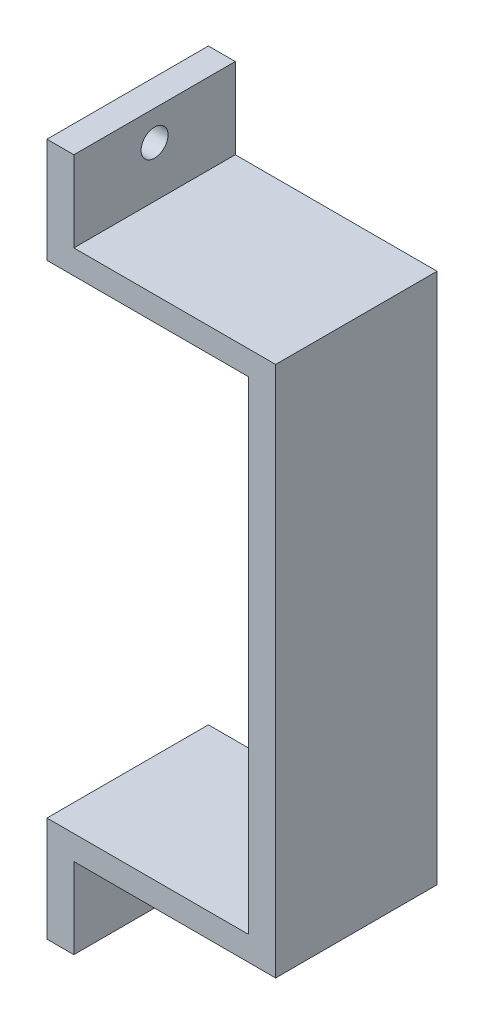
ISO-10303-21;
HEADER;
FILE_DESCRIPTION(('STEP AP214'),'2;1');
FILE_NAME('part.step','',(''),(''),'','','');
FILE_SCHEMA(('AUTOMOTIVE_DESIGN { 1 0 10303 214 1 1 1 1 }'));
ENDSEC;
DATA;
#1=APPLICATION_CONTEXT('core data for automotive mechanical design processes');
#2=APPLICATION_PROTOCOL_DEFINITION('international standard','automotive_design',2000,#1);
#3=PRODUCT_CONTEXT('',#1,'mechanical');
#4=PRODUCT('Part','Part','',(#3));
#5=PRODUCT_RELATED_PRODUCT_CATEGORY('part','',(#4));
#6=PRODUCT_DEFINITION_FORMATION('','',#4);
#7=PRODUCT_DEFINITION_CONTEXT('part definition',#1,'design');
#8=PRODUCT_DEFINITION('design','',#6,#7);
#9=PRODUCT_DEFINITION_SHAPE('','',#8);
#10=(LENGTH_UNIT() NAMED_UNIT(*) SI_UNIT(.MILLI.,.METRE.));
#11=(NAMED_UNIT(*) PLANE_ANGLE_UNIT() SI_UNIT($,.RADIAN.));
#12=(NAMED_UNIT(*) SI_UNIT($,.STERADIAN.) SOLID_ANGLE_UNIT());
#13=UNCERTAINTY_MEASURE_WITH_UNIT(LENGTH_MEASURE(1.E-05),#10,'distance_accuracy_value','');
#14=(GEOMETRIC_REPRESENTATION_CONTEXT(3) GLOBAL_UNCERTAINTY_ASSIGNED_CONTEXT((#13)) GLOBAL_UNIT_ASSIGNED_CONTEXT((#10,
#11,#12)) REPRESENTATION_CONTEXT('',''));
#15=CARTESIAN_POINT('',(0.,0.,0.));
#16=DIRECTION('',(0.,0.,1.));
#17=DIRECTION('',(1.,0.,0.));
#18=AXIS2_PLACEMENT_3D('',#15,#16,#17);
#19=CARTESIAN_POINT('',(0.,25.75,12.));
#20=DIRECTION('',(0.,-1.,0.));
#21=DIRECTION('',(0.,0.,-1.));
#22=AXIS2_PLACEMENT_3D('',#19,#20,#21);
#23=PLANE('',#22);
#24=DIRECTION('',(-1.,0.,0.));
#25=VECTOR('',#24,1.);
#26=CARTESIAN_POINT('',(0.,25.75,0.));
#27=LINE('',#26,#25);
#28=CARTESIAN_POINT('',(2.,25.75,0.));
#29=VERTEX_POINT('',#28);
#30=CARTESIAN_POINT('',(0.,25.75,0.));
#31=VERTEX_POINT('',#30);
#32=EDGE_CURVE('E155',#29,#31,#27,.T.);
#33=ORIENTED_EDGE('',*,*,#32,.T.);
#34=DIRECTION('',(0.,0.,-1.));
#35=VECTOR('',#34,1.);
#36=CARTESIAN_POINT('',(0.,25.75,12.));
#37=LINE('',#36,#35);
#38=CARTESIAN_POINT('',(0.,25.75,12.));
#39=VERTEX_POINT('',#38);
#40=EDGE_CURVE('E11',#39,#31,#37,.T.);
#41=ORIENTED_EDGE('',*,*,#40,.F.);
#42=DIRECTION('',(-1.,0.,0.));
#43=VECTOR('',#42,1.);
#44=CARTESIAN_POINT('',(0.,25.75,12.));
#45=LINE('',#44,#43);
#46=CARTESIAN_POINT('',(2.,25.75,12.));
#47=VERTEX_POINT('',#46);
#48=EDGE_CURVE('E178',#47,#39,#45,.T.);
#49=ORIENTED_EDGE('',*,*,#48,.F.);
#50=DIRECTION('',(0.,0.,-1.));
#51=VECTOR('',#50,1.);
#52=CARTESIAN_POINT('',(2.,25.75,12.));
#53=LINE('',#52,#51);
#54=EDGE_CURVE('E151',#47,#29,#53,.T.);
#55=ORIENTED_EDGE('',*,*,#54,.T.);
#56=EDGE_LOOP('',(#33,#41,#49,#55));
#57=FACE_BOUND('',#56,.T.);
#58=ADVANCED_FACE('F33',(#57),#23,.F.);
#59=CARTESIAN_POINT('',(0.,25.75,12.));
#60=DIRECTION('',(1.,0.,0.));
#61=DIRECTION('',(0.,1.,0.));
#62=AXIS2_PLACEMENT_3D('',#59,#60,#61);
#63=PLANE('',#62);
#64=CARTESIAN_POINT('',(0.,23.5311167080973,6.));
#65=DIRECTION('',(-1.,0.,0.));
#66=DIRECTION('',(0.,-1.,0.));
#67=AXIS2_PLACEMENT_3D('',#64,#65,#66);
#68=CIRCLE('',#67,1.);
#69=CARTESIAN_POINT('',(0.,22.5311167080973,6.));
#70=VERTEX_POINT('',#69);
#71=EDGE_CURVE('E202',#70,#70,#68,.T.);
#72=ORIENTED_EDGE('',*,*,#71,.F.);
#73=EDGE_LOOP('',(#72));
#74=FACE_BOUND('',#73,.T.);
#75=DIRECTION('',(0.,-1.,0.));
#76=VECTOR('',#75,1.);
#77=CARTESIAN_POINT('',(0.,25.75,0.));
#78=LINE('',#77,#76);
#79=CARTESIAN_POINT('',(0.,17.95,0.));
#80=VERTEX_POINT('',#79);
#81=EDGE_CURVE('E158',#31,#80,#78,.T.);
#82=ORIENTED_EDGE('',*,*,#81,.T.);
#83=DIRECTION('',(0.,0.,-1.));
#84=VECTOR('',#83,1.);
#85=CARTESIAN_POINT('',(0.,17.95,12.));
#86=LINE('',#85,#84);
#87=CARTESIAN_POINT('',(0.,17.95,12.));
#88=VERTEX_POINT('',#87);
#89=EDGE_CURVE('E42',#88,#80,#86,.T.);
#90=ORIENTED_EDGE('',*,*,#89,.F.);
#91=DIRECTION('',(0.,-1.,0.));
#92=VECTOR('',#91,1.);
#93=CARTESIAN_POINT('',(0.,25.75,12.));
#94=LINE('',#93,#92);
#95=EDGE_CURVE('E106',#39,#88,#94,.T.);
#96=ORIENTED_EDGE('',*,*,#95,.F.);
#97=ORIENTED_EDGE('',*,*,#40,.T.);
#98=EDGE_LOOP('',(#82,#90,#96,#97));
#99=FACE_BOUND('',#98,.T.);
#100=ADVANCED_FACE('F254',(#74,#99),#63,.F.);
#101=CARTESIAN_POINT('',(0.,17.95,12.));
#102=DIRECTION('',(0.,1.,0.));
#103=DIRECTION('',(0.,0.,1.));
#104=AXIS2_PLACEMENT_3D('',#101,#102,#103);
#105=PLANE('',#104);
#106=DIRECTION('',(1.,0.,0.));
#107=VECTOR('',#106,1.);
#108=CARTESIAN_POINT('',(0.,17.95,0.));
#109=LINE('',#108,#107);
#110=CARTESIAN_POINT('',(15.,17.95,0.));
#111=VERTEX_POINT('',#110);
#112=EDGE_CURVE('E161',#80,#111,#109,.T.);
#113=ORIENTED_EDGE('',*,*,#112,.T.);
#114=DIRECTION('',(0.,0.,-1.));
#115=VECTOR('',#114,1.);
#116=CARTESIAN_POINT('',(15.,17.95,12.));
#117=LINE('',#116,#115);
#118=CARTESIAN_POINT('',(15.,17.95,12.));
#119=VERTEX_POINT('',#118);
#120=EDGE_CURVE('E197',#119,#111,#117,.T.);
#121=ORIENTED_EDGE('',*,*,#120,.F.);
#122=DIRECTION('',(1.,0.,0.));
#123=VECTOR('',#122,1.);
#124=CARTESIAN_POINT('',(0.,17.95,12.));
#125=LINE('',#124,#123);
#126=EDGE_CURVE('E215',#88,#119,#125,.T.);
#127=ORIENTED_EDGE('',*,*,#126,.F.);
#128=ORIENTED_EDGE('',*,*,#89,.T.);
#129=EDGE_LOOP('',(#113,#121,#127,#128));
#130=FACE_BOUND('',#129,.T.);
#131=ADVANCED_FACE('F258',(#130),#105,.F.);
#132=CARTESIAN_POINT('',(15.,17.95,12.));
#133=DIRECTION('',(1.,0.,0.));
#134=DIRECTION('',(0.,1.,0.));
#135=AXIS2_PLACEMENT_3D('',#132,#133,#134);
#136=PLANE('',#135);
#137=DIRECTION('',(0.,-1.,0.));
#138=VECTOR('',#137,1.);
#139=CARTESIAN_POINT('',(15.,17.95,0.));
#140=LINE('',#139,#138);
#141=CARTESIAN_POINT('',(15.,-17.95,0.));
#142=VERTEX_POINT('',#141);
#143=EDGE_CURVE('E163',#111,#142,#140,.T.);
#144=ORIENTED_EDGE('',*,*,#143,.T.);
#145=DIRECTION('',(0.,0.,-1.));
#146=VECTOR('',#145,1.);
#147=CARTESIAN_POINT('',(15.,-17.95,12.));
#148=LINE('',#147,#146);
#149=CARTESIAN_POINT('',(15.,-17.95,12.));
#150=VERTEX_POINT('',#149);
#151=EDGE_CURVE('E194',#150,#142,#148,.T.);
#152=ORIENTED_EDGE('',*,*,#151,.F.);
#153=DIRECTION('',(0.,-1.,0.));
#154=VECTOR('',#153,1.);
#155=CARTESIAN_POINT('',(15.,17.95,12.));
#156=LINE('',#155,#154);
#157=EDGE_CURVE('E217',#119,#150,#156,.T.);
#158=ORIENTED_EDGE('',*,*,#157,.F.);
#159=ORIENTED_EDGE('',*,*,#120,.T.);
#160=EDGE_LOOP('',(#144,#152,#158,#159));
#161=FACE_BOUND('',#160,.T.);
#162=ADVANCED_FACE('F263',(#161),#136,.F.);
#163=CARTESIAN_POINT('',(15.,-17.95,12.));
#164=DIRECTION('',(0.,-1.,0.));
#165=DIRECTION('',(1.,0.,0.));
#166=AXIS2_PLACEMENT_3D('',#163,#164,#165);
#167=PLANE('',#166);
#168=DIRECTION('',(-1.,0.,0.));
#169=VECTOR('',#168,1.);
#170=CARTESIAN_POINT('',(15.,-17.95,0.));
#171=LINE('',#170,#169);
#172=CARTESIAN_POINT('',(0.,-17.95,0.));
#173=VERTEX_POINT('',#172);
#174=EDGE_CURVE('E165',#142,#173,#171,.T.);
#175=ORIENTED_EDGE('',*,*,#174,.T.);
#176=DIRECTION('',(0.,0.,-1.));
#177=VECTOR('',#176,1.);
#178=CARTESIAN_POINT('',(0.,-17.95,12.));
#179=LINE('',#178,#177);
#180=CARTESIAN_POINT('',(0.,-17.95,12.));
#181=VERTEX_POINT('',#180);
#182=EDGE_CURVE('E191',#181,#173,#179,.T.);
#183=ORIENTED_EDGE('',*,*,#182,.F.);
#184=DIRECTION('',(-1.,0.,0.));
#185=VECTOR('',#184,1.);
#186=CARTESIAN_POINT('',(15.,-17.95,12.));
#187=LINE('',#186,#185);
#188=EDGE_CURVE('E219',#150,#181,#187,.T.);
#189=ORIENTED_EDGE('',*,*,#188,.F.);
#190=ORIENTED_EDGE('',*,*,#151,.T.);
#191=EDGE_LOOP('',(#175,#183,#189,#190));
#192=FACE_BOUND('',#191,.T.);
#193=ADVANCED_FACE('F269',(#192),#167,.F.);
#194=CARTESIAN_POINT('',(0.,-17.95,12.));
#195=DIRECTION('',(1.,0.,0.));
#196=DIRECTION('',(0.,1.,0.));
#197=AXIS2_PLACEMENT_3D('',#194,#195,#196);
#198=PLANE('',#197);
#199=CARTESIAN_POINT('',(0.,-22.75,6.));
#200=DIRECTION('',(-1.,0.,0.));
#201=DIRECTION('',(0.,-1.,0.));
#202=AXIS2_PLACEMENT_3D('',#199,#200,#201);
#203=CIRCLE('',#202,1.);
#204=CARTESIAN_POINT('',(0.,-23.75,6.));
#205=VERTEX_POINT('',#204);
#206=EDGE_CURVE('E210',#205,#205,#203,.T.);
#207=ORIENTED_EDGE('',*,*,#206,.F.);
#208=EDGE_LOOP('',(#207));
#209=FACE_BOUND('',#208,.T.);
#210=DIRECTION('',(0.,-1.,0.));
#211=VECTOR('',#210,1.);
#212=CARTESIAN_POINT('',(0.,-17.95,0.));
#213=LINE('',#212,#211);
#214=CARTESIAN_POINT('',(0.,-25.75,0.));
#215=VERTEX_POINT('',#214);
#216=EDGE_CURVE('E167',#173,#215,#213,.T.);
#217=ORIENTED_EDGE('',*,*,#216,.T.);
#218=DIRECTION('',(0.,0.,-1.));
#219=VECTOR('',#218,1.);
#220=CARTESIAN_POINT('',(0.,-25.75,12.));
#221=LINE('',#220,#219);
#222=CARTESIAN_POINT('',(0.,-25.75,12.));
#223=VERTEX_POINT('',#222);
#224=EDGE_CURVE('E188',#223,#215,#221,.T.);
#225=ORIENTED_EDGE('',*,*,#224,.F.);
#226=DIRECTION('',(0.,-1.,0.));
#227=VECTOR('',#226,1.);
#228=CARTESIAN_POINT('',(0.,-17.95,12.));
#229=LINE('',#228,#227);
#230=EDGE_CURVE('E221',#181,#223,#229,.T.);
#231=ORIENTED_EDGE('',*,*,#230,.F.);
#232=ORIENTED_EDGE('',*,*,#182,.T.);
#233=EDGE_LOOP('',(#217,#225,#231,#232));
#234=FACE_BOUND('',#233,.T.);
#235=ADVANCED_FACE('F273',(#209,#234),#198,.F.);
#236=CARTESIAN_POINT('',(2.00000000000001,-25.75,12.));
#237=DIRECTION('',(0.,1.,0.));
#238=DIRECTION('',(0.,0.,1.));
#239=AXIS2_PLACEMENT_3D('',#236,#237,#238);
#240=PLANE('',#239);
#241=DIRECTION('',(1.,0.,0.));
#242=VECTOR('',#241,1.);
#243=CARTESIAN_POINT('',(2.00000000000001,-25.75,0.));
#244=LINE('',#243,#242);
#245=CARTESIAN_POINT('',(2.00000000000001,-25.75,0.));
#246=VERTEX_POINT('',#245);
#247=EDGE_CURVE('E169',#215,#246,#244,.T.);
#248=ORIENTED_EDGE('',*,*,#247,.T.);
#249=DIRECTION('',(0.,0.,-1.));
#250=VECTOR('',#249,1.);
#251=CARTESIAN_POINT('',(2.00000000000001,-25.75,12.));
#252=LINE('',#251,#250);
#253=CARTESIAN_POINT('',(2.00000000000001,-25.75,12.));
#254=VERTEX_POINT('',#253);
#255=EDGE_CURVE('E185',#254,#246,#252,.T.);
#256=ORIENTED_EDGE('',*,*,#255,.F.);
#257=DIRECTION('',(1.,0.,0.));
#258=VECTOR('',#257,1.);
#259=CARTESIAN_POINT('',(2.00000000000001,-25.75,12.));
#260=LINE('',#259,#258);
#261=EDGE_CURVE('E223',#223,#254,#260,.T.);
#262=ORIENTED_EDGE('',*,*,#261,.F.);
#263=ORIENTED_EDGE('',*,*,#224,.T.);
#264=EDGE_LOOP('',(#248,#256,#262,#263));
#265=FACE_BOUND('',#264,.T.);
#266=ADVANCED_FACE('F277',(#265),#240,.F.);
#267=CARTESIAN_POINT('',(2.00000000000001,-19.75,12.));
#268=DIRECTION('',(-1.,0.,0.));
#269=DIRECTION('',(0.,-1.,0.));
#270=AXIS2_PLACEMENT_3D('',#267,#268,#269);
#271=PLANE('',#270);
#272=CARTESIAN_POINT('',(2.00000000000001,-22.75,6.));
#273=DIRECTION('',(-1.,0.,0.));
#274=DIRECTION('',(0.,-1.,0.));
#275=AXIS2_PLACEMENT_3D('',#272,#273,#274);
#276=CIRCLE('',#275,1.);
#277=CARTESIAN_POINT('',(2.00000000000001,-23.75,6.));
#278=VERTEX_POINT('',#277);
#279=EDGE_CURVE('E36',#278,#278,#276,.T.);
#280=ORIENTED_EDGE('',*,*,#279,.T.);
#281=EDGE_LOOP('',(#280));
#282=FACE_BOUND('',#281,.T.);
#283=DIRECTION('',(0.,1.,0.));
#284=VECTOR('',#283,1.);
#285=CARTESIAN_POINT('',(2.00000000000001,-19.75,0.));
#286=LINE('',#285,#284);
#287=CARTESIAN_POINT('',(2.00000000000001,-19.75,0.));
#288=VERTEX_POINT('',#287);
#289=EDGE_CURVE('E171',#246,#288,#286,.T.);
#290=ORIENTED_EDGE('',*,*,#289,.T.);
#291=DIRECTION('',(0.,0.,-1.));
#292=VECTOR('',#291,1.);
#293=CARTESIAN_POINT('',(2.00000000000001,-19.75,12.));
#294=LINE('',#293,#292);
#295=CARTESIAN_POINT('',(2.00000000000001,-19.75,12.));
#296=VERTEX_POINT('',#295);
#297=EDGE_CURVE('E182',#296,#288,#294,.T.);
#298=ORIENTED_EDGE('',*,*,#297,.F.);
#299=DIRECTION('',(0.,1.,0.));
#300=VECTOR('',#299,1.);
#301=CARTESIAN_POINT('',(2.00000000000001,-19.75,12.));
#302=LINE('',#301,#300);
#303=EDGE_CURVE('E225',#254,#296,#302,.T.);
#304=ORIENTED_EDGE('',*,*,#303,.F.);
#305=ORIENTED_EDGE('',*,*,#255,.T.);
#306=EDGE_LOOP('',(#290,#298,#304,#305));
#307=FACE_BOUND('',#306,.T.);
#308=ADVANCED_FACE('F231',(#282,#307),#271,.F.);
#309=CARTESIAN_POINT('',(17.,-19.75,12.));
#310=DIRECTION('',(0.,1.,0.));
#311=DIRECTION('',(-1.,0.,0.));
#312=AXIS2_PLACEMENT_3D('',#309,#310,#311);
#313=PLANE('',#312);
#314=DIRECTION('',(1.,0.,0.));
#315=VECTOR('',#314,1.);
#316=CARTESIAN_POINT('',(17.,-19.75,0.));
#317=LINE('',#316,#315);
#318=CARTESIAN_POINT('',(17.,-19.75,0.));
#319=VERTEX_POINT('',#318);
#320=EDGE_CURVE('E173',#288,#319,#317,.T.);
#321=ORIENTED_EDGE('',*,*,#320,.T.);
#322=DIRECTION('',(0.,0.,-1.));
#323=VECTOR('',#322,1.);
#324=CARTESIAN_POINT('',(17.,-19.75,12.));
#325=LINE('',#324,#323);
#326=CARTESIAN_POINT('',(17.,-19.75,12.));
#327=VERTEX_POINT('',#326);
#328=EDGE_CURVE('E146',#327,#319,#325,.T.);
#329=ORIENTED_EDGE('',*,*,#328,.F.);
#330=DIRECTION('',(1.,0.,0.));
#331=VECTOR('',#330,1.);
#332=CARTESIAN_POINT('',(17.,-19.75,12.));
#333=LINE('',#332,#331);
#334=EDGE_CURVE('E137',#296,#327,#333,.T.);
#335=ORIENTED_EDGE('',*,*,#334,.F.);
#336=ORIENTED_EDGE('',*,*,#297,.T.);
#337=EDGE_LOOP('',(#321,#329,#335,#336));
#338=FACE_BOUND('',#337,.T.);
#339=ADVANCED_FACE('F235',(#338),#313,.F.);
#340=CARTESIAN_POINT('',(17.,19.75,12.));
#341=DIRECTION('',(-1.,0.,0.));
#342=DIRECTION('',(0.,-1.,0.));
#343=AXIS2_PLACEMENT_3D('',#340,#341,#342);
#344=PLANE('',#343);
#345=DIRECTION('',(0.,1.,0.));
#346=VECTOR('',#345,1.);
#347=CARTESIAN_POINT('',(17.,19.75,0.));
#348=LINE('',#347,#346);
#349=CARTESIAN_POINT('',(17.,19.75,0.));
#350=VERTEX_POINT('',#349);
#351=EDGE_CURVE('E145',#319,#350,#348,.T.);
#352=ORIENTED_EDGE('',*,*,#351,.T.);
#353=DIRECTION('',(0.,0.,-1.));
#354=VECTOR('',#353,1.);
#355=CARTESIAN_POINT('',(17.,19.75,12.));
#356=LINE('',#355,#354);
#357=CARTESIAN_POINT('',(17.,19.75,12.));
#358=VERTEX_POINT('',#357);
#359=EDGE_CURVE('E142',#358,#350,#356,.T.);
#360=ORIENTED_EDGE('',*,*,#359,.F.);
#361=DIRECTION('',(0.,1.,0.));
#362=VECTOR('',#361,1.);
#363=CARTESIAN_POINT('',(17.,19.75,12.));
#364=LINE('',#363,#362);
#365=EDGE_CURVE('E131',#327,#358,#364,.T.);
#366=ORIENTED_EDGE('',*,*,#365,.F.);
#367=ORIENTED_EDGE('',*,*,#328,.T.);
#368=EDGE_LOOP('',(#352,#360,#366,#367));
#369=FACE_BOUND('',#368,.T.);
#370=ADVANCED_FACE('F143',(#369),#344,.F.);
#371=CARTESIAN_POINT('',(2.,19.75,12.));
#372=DIRECTION('',(0.,-1.,0.));
#373=DIRECTION('',(0.,0.,-1.));
#374=AXIS2_PLACEMENT_3D('',#371,#372,#373);
#375=PLANE('',#374);
#376=DIRECTION('',(-1.,0.,0.));
#377=VECTOR('',#376,1.);
#378=CARTESIAN_POINT('',(2.,19.75,0.));
#379=LINE('',#378,#377);
#380=CARTESIAN_POINT('',(2.,19.75,0.));
#381=VERTEX_POINT('',#380);
#382=EDGE_CURVE('E92',#350,#381,#379,.T.);
#383=ORIENTED_EDGE('',*,*,#382,.T.);
#384=DIRECTION('',(0.,0.,-1.));
#385=VECTOR('',#384,1.);
#386=CARTESIAN_POINT('',(2.,19.75,12.));
#387=LINE('',#386,#385);
#388=CARTESIAN_POINT('',(2.,19.75,12.));
#389=VERTEX_POINT('',#388);
#390=EDGE_CURVE('E147',#389,#381,#387,.T.);
#391=ORIENTED_EDGE('',*,*,#390,.F.);
#392=DIRECTION('',(-1.,0.,0.));
#393=VECTOR('',#392,1.);
#394=CARTESIAN_POINT('',(2.,19.75,12.));
#395=LINE('',#394,#393);
#396=EDGE_CURVE('E135',#358,#389,#395,.T.);
#397=ORIENTED_EDGE('',*,*,#396,.F.);
#398=ORIENTED_EDGE('',*,*,#359,.T.);
#399=EDGE_LOOP('',(#383,#391,#397,#398));
#400=FACE_BOUND('',#399,.T.);
#401=ADVANCED_FACE('F149',(#400),#375,.F.);
#402=CARTESIAN_POINT('',(2.,25.75,12.));
#403=DIRECTION('',(-1.,0.,0.));
#404=DIRECTION('',(0.,-1.,0.));
#405=AXIS2_PLACEMENT_3D('',#402,#403,#404);
#406=PLANE('',#405);
#407=CARTESIAN_POINT('',(2.,23.5311167080973,6.));
#408=DIRECTION('',(-1.,0.,0.));
#409=DIRECTION('',(0.,-1.,0.));
#410=AXIS2_PLACEMENT_3D('',#407,#408,#409);
#411=CIRCLE('',#410,1.);
#412=CARTESIAN_POINT('',(2.,22.5311167080973,6.));
#413=VERTEX_POINT('',#412);
#414=EDGE_CURVE('E159',#413,#413,#411,.T.);
#415=ORIENTED_EDGE('',*,*,#414,.T.);
#416=EDGE_LOOP('',(#415));
#417=FACE_BOUND('',#416,.T.);
#418=DIRECTION('',(0.,1.,0.));
#419=VECTOR('',#418,1.);
#420=CARTESIAN_POINT('',(2.,25.75,0.));
#421=LINE('',#420,#419);
#422=EDGE_CURVE('E98',#381,#29,#421,.T.);
#423=ORIENTED_EDGE('',*,*,#422,.T.);
#424=ORIENTED_EDGE('',*,*,#54,.F.);
#425=DIRECTION('',(0.,1.,0.));
#426=VECTOR('',#425,1.);
#427=CARTESIAN_POINT('',(2.,25.75,12.));
#428=LINE('',#427,#426);
#429=EDGE_CURVE('E51',#389,#47,#428,.T.);
#430=ORIENTED_EDGE('',*,*,#429,.F.);
#431=ORIENTED_EDGE('',*,*,#390,.T.);
#432=EDGE_LOOP('',(#423,#424,#430,#431));
#433=FACE_BOUND('',#432,.T.);
#434=ADVANCED_FACE('F243',(#417,#433),#406,.F.);
#435=CARTESIAN_POINT('',(0.,0.,12.));
#436=DIRECTION('',(0.,0.,-1.));
#437=DIRECTION('',(-1.,0.,0.));
#438=AXIS2_PLACEMENT_3D('',#435,#436,#437);
#439=PLANE('',#438);
#440=ORIENTED_EDGE('',*,*,#48,.T.);
#441=ORIENTED_EDGE('',*,*,#95,.T.);
#442=ORIENTED_EDGE('',*,*,#126,.T.);
#443=ORIENTED_EDGE('',*,*,#157,.T.);
#444=ORIENTED_EDGE('',*,*,#188,.T.);
#445=ORIENTED_EDGE('',*,*,#230,.T.);
#446=ORIENTED_EDGE('',*,*,#261,.T.);
#447=ORIENTED_EDGE('',*,*,#303,.T.);
#448=ORIENTED_EDGE('',*,*,#334,.T.);
#449=ORIENTED_EDGE('',*,*,#365,.T.);
#450=ORIENTED_EDGE('',*,*,#396,.T.);
#451=ORIENTED_EDGE('',*,*,#429,.T.);
#452=EDGE_LOOP('',(#440,#441,#442,#443,#444,#445,#446,#447,#448,#449,#450,#451));
#453=FACE_BOUND('',#452,.T.);
#454=ADVANCED_FACE('F133',(#453),#439,.F.);
#455=CARTESIAN_POINT('',(0.,0.,0.));
#456=DIRECTION('',(0.,0.,-1.));
#457=DIRECTION('',(-1.,0.,0.));
#458=AXIS2_PLACEMENT_3D('',#455,#456,#457);
#459=PLANE('',#458);
#460=ORIENTED_EDGE('',*,*,#32,.F.);
#461=ORIENTED_EDGE('',*,*,#422,.F.);
#462=ORIENTED_EDGE('',*,*,#382,.F.);
#463=ORIENTED_EDGE('',*,*,#351,.F.);
#464=ORIENTED_EDGE('',*,*,#320,.F.);
#465=ORIENTED_EDGE('',*,*,#289,.F.);
#466=ORIENTED_EDGE('',*,*,#247,.F.);
#467=ORIENTED_EDGE('',*,*,#216,.F.);
#468=ORIENTED_EDGE('',*,*,#174,.F.);
#469=ORIENTED_EDGE('',*,*,#143,.F.);
#470=ORIENTED_EDGE('',*,*,#112,.F.);
#471=ORIENTED_EDGE('',*,*,#81,.F.);
#472=EDGE_LOOP('',(#460,#461,#462,#463,#464,#465,#466,#467,#468,#469,#470,#471));
#473=FACE_BOUND('',#472,.T.);
#474=ADVANCED_FACE('F238',(#473),#459,.T.);
#475=CARTESIAN_POINT('',(3.,23.5311167080973,6.));
#476=DIRECTION('',(-1.,0.,0.));
#477=DIRECTION('',(0.,-1.,0.));
#478=AXIS2_PLACEMENT_3D('',#475,#476,#477);
#479=CYLINDRICAL_SURFACE('',#478,1.);
#480=ORIENTED_EDGE('',*,*,#71,.T.);
#481=EDGE_LOOP('',(#480));
#482=FACE_BOUND('',#481,.T.);
#483=ORIENTED_EDGE('',*,*,#414,.F.);
#484=EDGE_LOOP('',(#483));
#485=FACE_BOUND('',#484,.T.);
#486=ADVANCED_FACE('F311',(#482,#485),#479,.F.);
#487=CARTESIAN_POINT('',(3.,-22.75,6.));
#488=DIRECTION('',(-1.,0.,0.));
#489=DIRECTION('',(0.,-1.,0.));
#490=AXIS2_PLACEMENT_3D('',#487,#488,#489);
#491=CYLINDRICAL_SURFACE('',#490,1.);
#492=ORIENTED_EDGE('',*,*,#206,.T.);
#493=EDGE_LOOP('',(#492));
#494=FACE_BOUND('',#493,.T.);
#495=ORIENTED_EDGE('',*,*,#279,.F.);
#496=EDGE_LOOP('',(#495));
#497=FACE_BOUND('',#496,.T.);
#498=ADVANCED_FACE('F344',(#494,#497),#491,.F.);
#499=CLOSED_SHELL('',(#58,#100,#131,#162,#193,#235,#266,#308,#339,#370,#401,#434,#454,#474,#486,#498));
#500=MANIFOLD_SOLID_BREP('B2',#499);
#501=ADVANCED_BREP_SHAPE_REPRESENTATION('',(#18,#500),#14);
#502=SHAPE_DEFINITION_REPRESENTATION(#9,#501);
ENDSEC;
END-ISO-10303-21;
